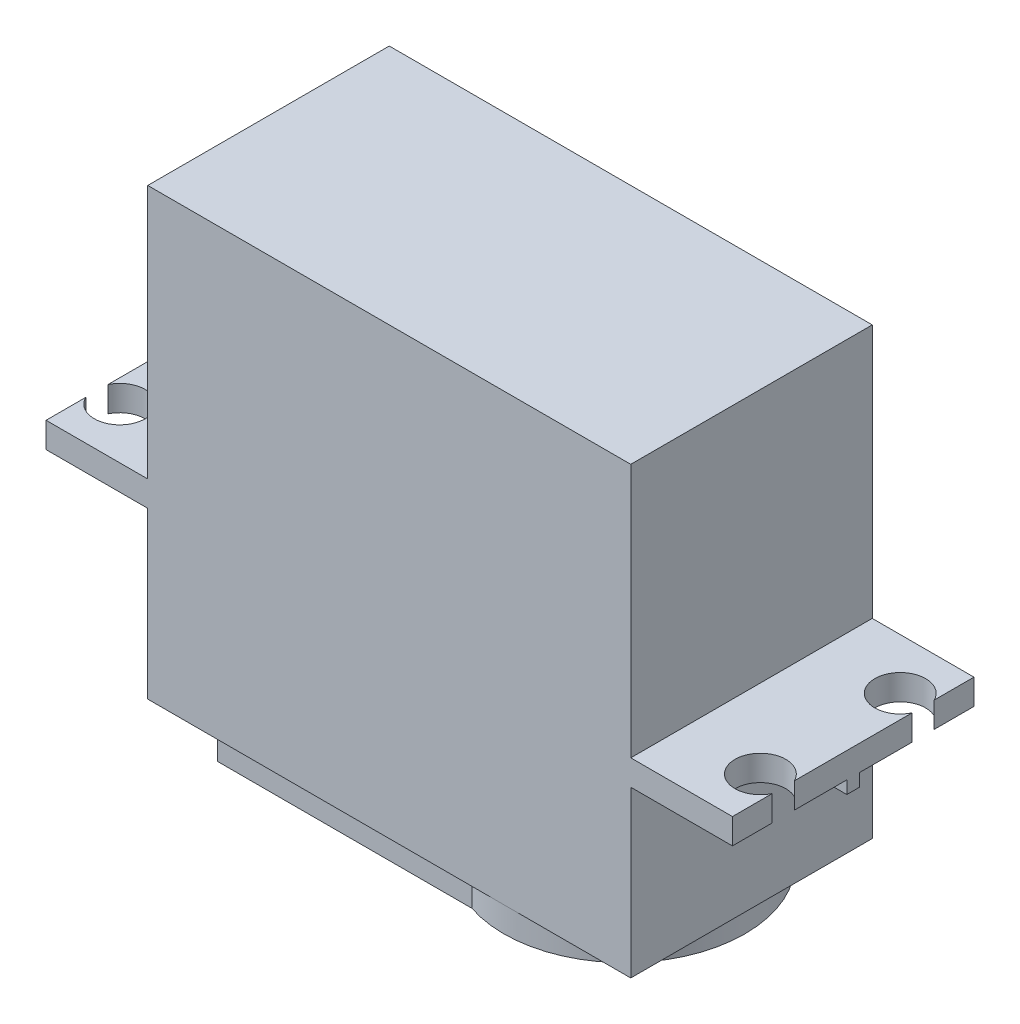
ISO-10303-21;
HEADER;
FILE_DESCRIPTION(('STEP AP214'),'2;1');
FILE_NAME('part.step','',(''),(''),'','','');
FILE_SCHEMA(('AUTOMOTIVE_DESIGN { 1 0 10303 214 1 1 1 1 }'));
ENDSEC;
DATA;
#1=APPLICATION_CONTEXT('core data for automotive mechanical design processes');
#2=APPLICATION_PROTOCOL_DEFINITION('international standard','automotive_design',2000,#1);
#3=PRODUCT_CONTEXT('',#1,'mechanical');
#4=PRODUCT('Part','Part','',(#3));
#5=PRODUCT_RELATED_PRODUCT_CATEGORY('part','',(#4));
#6=PRODUCT_DEFINITION_FORMATION('','',#4);
#7=PRODUCT_DEFINITION_CONTEXT('part definition',#1,'design');
#8=PRODUCT_DEFINITION('design','',#6,#7);
#9=PRODUCT_DEFINITION_SHAPE('','',#8);
#10=(LENGTH_UNIT() NAMED_UNIT(*) SI_UNIT(.MILLI.,.METRE.));
#11=(NAMED_UNIT(*) PLANE_ANGLE_UNIT() SI_UNIT($,.RADIAN.));
#12=(NAMED_UNIT(*) SI_UNIT($,.STERADIAN.) SOLID_ANGLE_UNIT());
#13=UNCERTAINTY_MEASURE_WITH_UNIT(LENGTH_MEASURE(1.E-05),#10,'distance_accuracy_value','');
#14=(GEOMETRIC_REPRESENTATION_CONTEXT(3) GLOBAL_UNCERTAINTY_ASSIGNED_CONTEXT((#13)) GLOBAL_UNIT_ASSIGNED_CONTEXT((#10,
#11,#12)) REPRESENTATION_CONTEXT('',''));
#15=CARTESIAN_POINT('',(0.,0.,0.));
#16=DIRECTION('',(0.,0.,1.));
#17=DIRECTION('',(1.,0.,0.));
#18=AXIS2_PLACEMENT_3D('',#15,#16,#17);
#19=CARTESIAN_POINT('',(19.,0.,19.));
#20=DIRECTION('',(0.,1.,0.));
#21=DIRECTION('',(0.,0.,1.));
#22=AXIS2_PLACEMENT_3D('',#19,#20,#21);
#23=PLANE('',#22);
#24=DIRECTION('',(1.,0.,0.));
#25=VECTOR('',#24,1.);
#26=CARTESIAN_POINT('',(19.,0.,0.));
#27=LINE('',#26,#25);
#28=CARTESIAN_POINT('',(-19.,0.,0.));
#29=VERTEX_POINT('',#28);
#30=CARTESIAN_POINT('',(19.,0.,0.));
#31=VERTEX_POINT('',#30);
#32=EDGE_CURVE('E402',#29,#31,#27,.T.);
#33=ORIENTED_EDGE('',*,*,#32,.T.);
#34=DIRECTION('',(0.,0.,-1.));
#35=VECTOR('',#34,1.);
#36=CARTESIAN_POINT('',(19.,0.,19.));
#37=LINE('',#36,#35);
#38=CARTESIAN_POINT('',(19.,0.,19.));
#39=VERTEX_POINT('',#38);
#40=EDGE_CURVE('E440',#39,#31,#37,.T.);
#41=ORIENTED_EDGE('',*,*,#40,.F.);
#42=DIRECTION('',(1.,0.,0.));
#43=VECTOR('',#42,1.);
#44=CARTESIAN_POINT('',(19.,0.,19.));
#45=LINE('',#44,#43);
#46=CARTESIAN_POINT('',(-19.,0.,19.));
#47=VERTEX_POINT('',#46);
#48=EDGE_CURVE('E374',#47,#39,#45,.T.);
#49=ORIENTED_EDGE('',*,*,#48,.F.);
#50=DIRECTION('',(0.,0.,-1.));
#51=VECTOR('',#50,1.);
#52=CARTESIAN_POINT('',(-19.,0.,19.));
#53=LINE('',#52,#51);
#54=EDGE_CURVE('E443',#47,#29,#53,.T.);
#55=ORIENTED_EDGE('',*,*,#54,.T.);
#56=EDGE_LOOP('',(#33,#41,#49,#55));
#57=FACE_BOUND('',#56,.T.);
#58=DIRECTION('',(0.,0.,-1.));
#59=VECTOR('',#58,1.);
#60=CARTESIAN_POINT('',(-14.,0.,18.5));
#61=LINE('',#60,#59);
#62=CARTESIAN_POINT('',(-14.,0.,18.5));
#63=VERTEX_POINT('',#62);
#64=CARTESIAN_POINT('',(-14.,0.,0.5));
#65=VERTEX_POINT('',#64);
#66=EDGE_CURVE('E263',#63,#65,#61,.T.);
#67=ORIENTED_EDGE('',*,*,#66,.F.);
#68=DIRECTION('',(-1.,0.,0.));
#69=VECTOR('',#68,1.);
#70=CARTESIAN_POINT('',(-14.,0.,18.5));
#71=LINE('',#70,#69);
#72=CARTESIAN_POINT('',(6.,0.,18.5));
#73=VERTEX_POINT('',#72);
#74=EDGE_CURVE('E260',#73,#63,#71,.T.);
#75=ORIENTED_EDGE('',*,*,#74,.F.);
#76=CARTESIAN_POINT('',(9.,0.,9.5));
#77=DIRECTION('',(0.,-1.,0.));
#78=DIRECTION('',(0.,0.,1.));
#79=AXIS2_PLACEMENT_3D('',#76,#77,#78);
#80=CIRCLE('',#79,9.48683298050514);
#81=CARTESIAN_POINT('',(6.,0.,0.5));
#82=VERTEX_POINT('',#81);
#83=EDGE_CURVE('E54',#82,#73,#80,.T.);
#84=ORIENTED_EDGE('',*,*,#83,.F.);
#85=DIRECTION('',(1.,0.,0.));
#86=VECTOR('',#85,1.);
#87=CARTESIAN_POINT('',(-14.,0.,0.5));
#88=LINE('',#87,#86);
#89=EDGE_CURVE('E49',#65,#82,#88,.T.);
#90=ORIENTED_EDGE('',*,*,#89,.F.);
#91=EDGE_LOOP('',(#67,#75,#84,#90));
#92=FACE_BOUND('',#91,.T.);
#93=ADVANCED_FACE('F34',(#57,#92),#23,.F.);
#94=CARTESIAN_POINT('',(19.,0.,19.));
#95=DIRECTION('',(-1.,0.,0.));
#96=DIRECTION('',(0.,0.,1.));
#97=AXIS2_PLACEMENT_3D('',#94,#95,#96);
#98=PLANE('',#97);
#99=DIRECTION('',(0.,1.,0.));
#100=VECTOR('',#99,1.);
#101=CARTESIAN_POINT('',(19.,12.,8.99999999999999));
#102=LINE('',#101,#100);
#103=CARTESIAN_POINT('',(19.,12.,8.99999999999999));
#104=VERTEX_POINT('',#103);
#105=CARTESIAN_POINT('',(19.,13.,8.99999999999999));
#106=VERTEX_POINT('',#105);
#107=EDGE_CURVE('E294',#104,#106,#102,.T.);
#108=ORIENTED_EDGE('',*,*,#107,.F.);
#109=DIRECTION('',(0.,0.,-1.));
#110=VECTOR('',#109,1.);
#111=CARTESIAN_POINT('',(19.,12.,9.99999999999999));
#112=LINE('',#111,#110);
#113=CARTESIAN_POINT('',(19.,12.,9.99999999999999));
#114=VERTEX_POINT('',#113);
#115=EDGE_CURVE('E273',#114,#104,#112,.T.);
#116=ORIENTED_EDGE('',*,*,#115,.F.);
#117=DIRECTION('',(0.,1.,0.));
#118=VECTOR('',#117,1.);
#119=CARTESIAN_POINT('',(19.,12.,9.99999999999999));
#120=LINE('',#119,#118);
#121=CARTESIAN_POINT('',(19.,13.,9.99999999999999));
#122=VERTEX_POINT('',#121);
#123=EDGE_CURVE('E282',#114,#122,#120,.T.);
#124=ORIENTED_EDGE('',*,*,#123,.T.);
#125=DIRECTION('',(0.,0.,-1.));
#126=VECTOR('',#125,1.);
#127=CARTESIAN_POINT('',(19.,13.,19.));
#128=LINE('',#127,#126);
#129=CARTESIAN_POINT('',(19.,13.,19.));
#130=VERTEX_POINT('',#129);
#131=EDGE_CURVE('E438',#130,#122,#128,.T.);
#132=ORIENTED_EDGE('',*,*,#131,.F.);
#133=DIRECTION('',(0.,1.,0.));
#134=VECTOR('',#133,1.);
#135=CARTESIAN_POINT('',(19.,0.,19.));
#136=LINE('',#135,#134);
#137=EDGE_CURVE('E376',#39,#130,#136,.T.);
#138=ORIENTED_EDGE('',*,*,#137,.F.);
#139=ORIENTED_EDGE('',*,*,#40,.T.);
#140=DIRECTION('',(0.,1.,0.));
#141=VECTOR('',#140,1.);
#142=CARTESIAN_POINT('',(19.,0.,0.));
#143=LINE('',#142,#141);
#144=CARTESIAN_POINT('',(19.,13.,0.));
#145=VERTEX_POINT('',#144);
#146=EDGE_CURVE('E404',#31,#145,#143,.T.);
#147=ORIENTED_EDGE('',*,*,#146,.T.);
#148=EDGE_CURVE('E435',#106,#145,#128,.T.);
#149=ORIENTED_EDGE('',*,*,#148,.F.);
#150=EDGE_LOOP('',(#108,#116,#124,#132,#138,#139,#147,#149));
#151=FACE_BOUND('',#150,.T.);
#152=ADVANCED_FACE('F557',(#151),#98,.F.);
#153=CARTESIAN_POINT('',(19.,13.,19.));
#154=DIRECTION('',(0.,1.,0.));
#155=DIRECTION('',(-1.,0.,0.));
#156=AXIS2_PLACEMENT_3D('',#153,#154,#155);
#157=PLANE('',#156);
#158=DIRECTION('',(1.,0.,0.));
#159=VECTOR('',#158,1.);
#160=CARTESIAN_POINT('',(19.,13.,8.99999999999999));
#161=LINE('',#160,#159);
#162=CARTESIAN_POINT('',(27.,13.,8.99999999999999));
#163=VERTEX_POINT('',#162);
#164=EDGE_CURVE('E264',#106,#163,#161,.T.);
#165=ORIENTED_EDGE('',*,*,#164,.F.);
#166=ORIENTED_EDGE('',*,*,#148,.T.);
#167=DIRECTION('',(1.,0.,0.));
#168=VECTOR('',#167,1.);
#169=CARTESIAN_POINT('',(19.,13.,0.));
#170=LINE('',#169,#168);
#171=CARTESIAN_POINT('',(27.,13.,0.));
#172=VERTEX_POINT('',#171);
#173=EDGE_CURVE('E407',#145,#172,#170,.T.);
#174=ORIENTED_EDGE('',*,*,#173,.T.);
#175=DIRECTION('',(0.,0.,-1.));
#176=VECTOR('',#175,1.);
#177=CARTESIAN_POINT('',(27.,13.,19.));
#178=LINE('',#177,#176);
#179=CARTESIAN_POINT('',(27.,13.,3.12822021129187));
#180=VERTEX_POINT('',#179);
#181=EDGE_CURVE('E430',#180,#172,#178,.T.);
#182=ORIENTED_EDGE('',*,*,#181,.F.);
#183=CARTESIAN_POINT('',(25.2,13.,4.));
#184=DIRECTION('',(0.,1.,0.));
#185=DIRECTION('',(-1.,0.,0.));
#186=AXIS2_PLACEMENT_3D('',#183,#184,#185);
#187=CIRCLE('',#186,2.);
#188=CARTESIAN_POINT('',(27.,13.,4.87177978870814));
#189=VERTEX_POINT('',#188);
#190=EDGE_CURVE('E334',#180,#189,#187,.T.);
#191=ORIENTED_EDGE('',*,*,#190,.T.);
#192=EDGE_CURVE('E437',#163,#189,#178,.T.);
#193=ORIENTED_EDGE('',*,*,#192,.F.);
#194=EDGE_LOOP('',(#165,#166,#174,#182,#191,#193));
#195=FACE_BOUND('',#194,.T.);
#196=ADVANCED_FACE('F554',(#195),#157,.F.);
#197=DIRECTION('',(-1.,0.,0.));
#198=VECTOR('',#197,1.);
#199=CARTESIAN_POINT('',(19.,13.,9.99999999999999));
#200=LINE('',#199,#198);
#201=CARTESIAN_POINT('',(27.,13.,9.99999999999999));
#202=VERTEX_POINT('',#201);
#203=EDGE_CURVE('E267',#202,#122,#200,.T.);
#204=ORIENTED_EDGE('',*,*,#203,.F.);
#205=CARTESIAN_POINT('',(27.,13.,14.1282202112919));
#206=VERTEX_POINT('',#205);
#207=EDGE_CURVE('E436',#206,#202,#178,.T.);
#208=ORIENTED_EDGE('',*,*,#207,.F.);
#209=CARTESIAN_POINT('',(25.2,13.,15.));
#210=DIRECTION('',(0.,1.,0.));
#211=DIRECTION('',(-1.,0.,0.));
#212=AXIS2_PLACEMENT_3D('',#209,#210,#211);
#213=CIRCLE('',#212,2.);
#214=CARTESIAN_POINT('',(27.,13.,15.8717797887081));
#215=VERTEX_POINT('',#214);
#216=EDGE_CURVE('E355',#206,#215,#213,.T.);
#217=ORIENTED_EDGE('',*,*,#216,.T.);
#218=CARTESIAN_POINT('',(27.,13.,19.));
#219=VERTEX_POINT('',#218);
#220=EDGE_CURVE('E432',#219,#215,#178,.T.);
#221=ORIENTED_EDGE('',*,*,#220,.F.);
#222=DIRECTION('',(1.,0.,0.));
#223=VECTOR('',#222,1.);
#224=CARTESIAN_POINT('',(19.,13.,19.));
#225=LINE('',#224,#223);
#226=EDGE_CURVE('E378',#130,#219,#225,.T.);
#227=ORIENTED_EDGE('',*,*,#226,.F.);
#228=ORIENTED_EDGE('',*,*,#131,.T.);
#229=EDGE_LOOP('',(#204,#208,#217,#221,#227,#228));
#230=FACE_BOUND('',#229,.T.);
#231=ADVANCED_FACE('F562',(#230),#157,.F.);
#232=CARTESIAN_POINT('',(-19.,13.,19.));
#233=DIRECTION('',(0.,1.,0.));
#234=DIRECTION('',(-1.,0.,0.));
#235=AXIS2_PLACEMENT_3D('',#232,#233,#234);
#236=PLANE('',#235);
#237=DIRECTION('',(-1.,0.,0.));
#238=VECTOR('',#237,1.);
#239=CARTESIAN_POINT('',(-19.,13.,10.));
#240=LINE('',#239,#238);
#241=CARTESIAN_POINT('',(-19.,13.,10.));
#242=VERTEX_POINT('',#241);
#243=CARTESIAN_POINT('',(-27.,13.,10.));
#244=VERTEX_POINT('',#243);
#245=EDGE_CURVE('E297',#242,#244,#240,.T.);
#246=ORIENTED_EDGE('',*,*,#245,.F.);
#247=DIRECTION('',(0.,0.,-1.));
#248=VECTOR('',#247,1.);
#249=CARTESIAN_POINT('',(-19.,13.,19.));
#250=LINE('',#249,#248);
#251=CARTESIAN_POINT('',(-19.,13.,19.));
#252=VERTEX_POINT('',#251);
#253=EDGE_CURVE('E447',#252,#242,#250,.T.);
#254=ORIENTED_EDGE('',*,*,#253,.F.);
#255=DIRECTION('',(1.,0.,0.));
#256=VECTOR('',#255,1.);
#257=CARTESIAN_POINT('',(-19.,13.,19.));
#258=LINE('',#257,#256);
#259=CARTESIAN_POINT('',(-27.,13.,19.));
#260=VERTEX_POINT('',#259);
#261=EDGE_CURVE('E370',#260,#252,#258,.T.);
#262=ORIENTED_EDGE('',*,*,#261,.F.);
#263=DIRECTION('',(0.,0.,-1.));
#264=VECTOR('',#263,1.);
#265=CARTESIAN_POINT('',(-27.,13.,19.));
#266=LINE('',#265,#264);
#267=CARTESIAN_POINT('',(-27.,13.,15.8717797887081));
#268=VERTEX_POINT('',#267);
#269=EDGE_CURVE('E451',#260,#268,#266,.T.);
#270=ORIENTED_EDGE('',*,*,#269,.T.);
#271=CARTESIAN_POINT('',(-25.2,13.,15.));
#272=DIRECTION('',(0.,1.,0.));
#273=DIRECTION('',(-1.,0.,0.));
#274=AXIS2_PLACEMENT_3D('',#271,#272,#273);
#275=CIRCLE('',#274,2.);
#276=CARTESIAN_POINT('',(-27.,13.,14.1282202112919));
#277=VERTEX_POINT('',#276);
#278=EDGE_CURVE('E42',#268,#277,#275,.T.);
#279=ORIENTED_EDGE('',*,*,#278,.T.);
#280=EDGE_CURVE('E455',#277,#244,#266,.T.);
#281=ORIENTED_EDGE('',*,*,#280,.T.);
#282=EDGE_LOOP('',(#246,#254,#262,#270,#279,#281));
#283=FACE_BOUND('',#282,.T.);
#284=ADVANCED_FACE('F469',(#283),#236,.F.);
#285=DIRECTION('',(1.,0.,0.));
#286=VECTOR('',#285,1.);
#287=CARTESIAN_POINT('',(-19.,13.,9.));
#288=LINE('',#287,#286);
#289=CARTESIAN_POINT('',(-27.,13.,9.));
#290=VERTEX_POINT('',#289);
#291=CARTESIAN_POINT('',(-19.,13.,9.));
#292=VERTEX_POINT('',#291);
#293=EDGE_CURVE('E302',#290,#292,#288,.T.);
#294=ORIENTED_EDGE('',*,*,#293,.F.);
#295=CARTESIAN_POINT('',(-27.,13.,4.87177978870813));
#296=VERTEX_POINT('',#295);
#297=EDGE_CURVE('E456',#290,#296,#266,.T.);
#298=ORIENTED_EDGE('',*,*,#297,.T.);
#299=CARTESIAN_POINT('',(-25.2,13.,4.));
#300=DIRECTION('',(0.,1.,0.));
#301=DIRECTION('',(-1.,0.,0.));
#302=AXIS2_PLACEMENT_3D('',#299,#300,#301);
#303=CIRCLE('',#302,2.);
#304=CARTESIAN_POINT('',(-27.,13.,3.12822021129187));
#305=VERTEX_POINT('',#304);
#306=EDGE_CURVE('E11',#296,#305,#303,.T.);
#307=ORIENTED_EDGE('',*,*,#306,.T.);
#308=CARTESIAN_POINT('',(-27.,13.,0.));
#309=VERTEX_POINT('',#308);
#310=EDGE_CURVE('E450',#305,#309,#266,.T.);
#311=ORIENTED_EDGE('',*,*,#310,.T.);
#312=DIRECTION('',(1.,0.,0.));
#313=VECTOR('',#312,1.);
#314=CARTESIAN_POINT('',(-19.,13.,0.));
#315=LINE('',#314,#313);
#316=CARTESIAN_POINT('',(-19.,13.,0.));
#317=VERTEX_POINT('',#316);
#318=EDGE_CURVE('E397',#309,#317,#315,.T.);
#319=ORIENTED_EDGE('',*,*,#318,.T.);
#320=EDGE_CURVE('E446',#292,#317,#250,.T.);
#321=ORIENTED_EDGE('',*,*,#320,.F.);
#322=EDGE_LOOP('',(#294,#298,#307,#311,#319,#321));
#323=FACE_BOUND('',#322,.T.);
#324=ADVANCED_FACE('F480',(#323),#236,.F.);
#325=CARTESIAN_POINT('',(-19.,0.,19.));
#326=DIRECTION('',(1.,0.,0.));
#327=DIRECTION('',(0.,0.,-1.));
#328=AXIS2_PLACEMENT_3D('',#325,#326,#327);
#329=PLANE('',#328);
#330=DIRECTION('',(0.,1.,0.));
#331=VECTOR('',#330,1.);
#332=CARTESIAN_POINT('',(-19.,12.,10.));
#333=LINE('',#332,#331);
#334=CARTESIAN_POINT('',(-19.,12.,10.));
#335=VERTEX_POINT('',#334);
#336=EDGE_CURVE('E310',#335,#242,#333,.T.);
#337=ORIENTED_EDGE('',*,*,#336,.F.);
#338=DIRECTION('',(0.,0.,1.));
#339=VECTOR('',#338,1.);
#340=CARTESIAN_POINT('',(-19.,12.,10.));
#341=LINE('',#340,#339);
#342=CARTESIAN_POINT('',(-19.,12.,9.));
#343=VERTEX_POINT('',#342);
#344=EDGE_CURVE('E307',#343,#335,#341,.T.);
#345=ORIENTED_EDGE('',*,*,#344,.F.);
#346=DIRECTION('',(0.,1.,0.));
#347=VECTOR('',#346,1.);
#348=CARTESIAN_POINT('',(-19.,12.,9.));
#349=LINE('',#348,#347);
#350=EDGE_CURVE('E317',#343,#292,#349,.T.);
#351=ORIENTED_EDGE('',*,*,#350,.T.);
#352=ORIENTED_EDGE('',*,*,#320,.T.);
#353=DIRECTION('',(0.,-1.,0.));
#354=VECTOR('',#353,1.);
#355=CARTESIAN_POINT('',(-19.,0.,0.));
#356=LINE('',#355,#354);
#357=EDGE_CURVE('E400',#317,#29,#356,.T.);
#358=ORIENTED_EDGE('',*,*,#357,.T.);
#359=ORIENTED_EDGE('',*,*,#54,.F.);
#360=DIRECTION('',(0.,-1.,0.));
#361=VECTOR('',#360,1.);
#362=CARTESIAN_POINT('',(-19.,0.,19.));
#363=LINE('',#362,#361);
#364=EDGE_CURVE('E372',#252,#47,#363,.T.);
#365=ORIENTED_EDGE('',*,*,#364,.F.);
#366=ORIENTED_EDGE('',*,*,#253,.T.);
#367=EDGE_LOOP('',(#337,#345,#351,#352,#358,#359,#365,#366));
#368=FACE_BOUND('',#367,.T.);
#369=ADVANCED_FACE('F496',(#368),#329,.F.);
#370=CARTESIAN_POINT('',(-27.,13.,19.));
#371=DIRECTION('',(1.,0.,0.));
#372=DIRECTION('',(0.,0.,-1.));
#373=AXIS2_PLACEMENT_3D('',#370,#371,#372);
#374=PLANE('',#373);
#375=ORIENTED_EDGE('',*,*,#310,.F.);
#376=DIRECTION('',(0.,1.,0.));
#377=VECTOR('',#376,1.);
#378=CARTESIAN_POINT('',(-27.,0.,3.12822021129187));
#379=LINE('',#378,#377);
#380=CARTESIAN_POINT('',(-27.,15.,3.12822021129187));
#381=VERTEX_POINT('',#380);
#382=EDGE_CURVE('E349',#305,#381,#379,.T.);
#383=ORIENTED_EDGE('',*,*,#382,.T.);
#384=DIRECTION('',(0.,0.,-1.));
#385=VECTOR('',#384,1.);
#386=CARTESIAN_POINT('',(-27.,15.,19.));
#387=LINE('',#386,#385);
#388=CARTESIAN_POINT('',(-27.,15.,0.));
#389=VERTEX_POINT('',#388);
#390=EDGE_CURVE('E454',#381,#389,#387,.T.);
#391=ORIENTED_EDGE('',*,*,#390,.T.);
#392=DIRECTION('',(0.,-1.,0.));
#393=VECTOR('',#392,1.);
#394=CARTESIAN_POINT('',(-27.,13.,0.));
#395=LINE('',#394,#393);
#396=EDGE_CURVE('E394',#389,#309,#395,.T.);
#397=ORIENTED_EDGE('',*,*,#396,.T.);
#398=EDGE_LOOP('',(#375,#383,#391,#397));
#399=FACE_BOUND('',#398,.T.);
#400=ADVANCED_FACE('F487',(#399),#374,.F.);
#401=CARTESIAN_POINT('',(-27.,15.,14.1282202112919));
#402=VERTEX_POINT('',#401);
#403=CARTESIAN_POINT('',(-27.,15.,4.87177978870813));
#404=VERTEX_POINT('',#403);
#405=EDGE_CURVE('E461',#402,#404,#387,.T.);
#406=ORIENTED_EDGE('',*,*,#405,.T.);
#407=DIRECTION('',(0.,1.,0.));
#408=VECTOR('',#407,1.);
#409=CARTESIAN_POINT('',(-27.,0.,4.87177978870814));
#410=LINE('',#409,#408);
#411=EDGE_CURVE('E346',#404,#296,#410,.F.);
#412=ORIENTED_EDGE('',*,*,#411,.T.);
#413=ORIENTED_EDGE('',*,*,#297,.F.);
#414=DIRECTION('',(0.,1.,0.));
#415=VECTOR('',#414,1.);
#416=CARTESIAN_POINT('',(-27.,12.,9.));
#417=LINE('',#416,#415);
#418=CARTESIAN_POINT('',(-27.,12.,9.));
#419=VERTEX_POINT('',#418);
#420=EDGE_CURVE('E319',#419,#290,#417,.T.);
#421=ORIENTED_EDGE('',*,*,#420,.F.);
#422=DIRECTION('',(0.,0.,-1.));
#423=VECTOR('',#422,1.);
#424=CARTESIAN_POINT('',(-27.,12.,9.));
#425=LINE('',#424,#423);
#426=CARTESIAN_POINT('',(-27.,12.,10.));
#427=VERTEX_POINT('',#426);
#428=EDGE_CURVE('E301',#427,#419,#425,.T.);
#429=ORIENTED_EDGE('',*,*,#428,.F.);
#430=DIRECTION('',(0.,1.,0.));
#431=VECTOR('',#430,1.);
#432=CARTESIAN_POINT('',(-27.,12.,10.));
#433=LINE('',#432,#431);
#434=EDGE_CURVE('E322',#427,#244,#433,.T.);
#435=ORIENTED_EDGE('',*,*,#434,.T.);
#436=ORIENTED_EDGE('',*,*,#280,.F.);
#437=DIRECTION('',(0.,1.,0.));
#438=VECTOR('',#437,1.);
#439=CARTESIAN_POINT('',(-27.,0.,14.1282202112919));
#440=LINE('',#439,#438);
#441=EDGE_CURVE('E343',#277,#402,#440,.T.);
#442=ORIENTED_EDGE('',*,*,#441,.T.);
#443=EDGE_LOOP('',(#406,#412,#413,#421,#429,#435,#436,#442));
#444=FACE_BOUND('',#443,.T.);
#445=ADVANCED_FACE('F475',(#444),#374,.F.);
#446=CARTESIAN_POINT('',(27.,13.,19.));
#447=DIRECTION('',(-1.,0.,0.));
#448=DIRECTION('',(0.,0.,1.));
#449=AXIS2_PLACEMENT_3D('',#446,#447,#448);
#450=PLANE('',#449);
#451=ORIENTED_EDGE('',*,*,#207,.T.);
#452=DIRECTION('',(0.,1.,0.));
#453=VECTOR('',#452,1.);
#454=CARTESIAN_POINT('',(27.,12.,9.99999999999999));
#455=LINE('',#454,#453);
#456=CARTESIAN_POINT('',(27.,12.,9.99999999999999));
#457=VERTEX_POINT('',#456);
#458=EDGE_CURVE('E288',#457,#202,#455,.T.);
#459=ORIENTED_EDGE('',*,*,#458,.F.);
#460=DIRECTION('',(0.,0.,1.));
#461=VECTOR('',#460,1.);
#462=CARTESIAN_POINT('',(27.,12.,8.99999999999999));
#463=LINE('',#462,#461);
#464=CARTESIAN_POINT('',(27.,12.,8.99999999999999));
#465=VERTEX_POINT('',#464);
#466=EDGE_CURVE('E278',#465,#457,#463,.T.);
#467=ORIENTED_EDGE('',*,*,#466,.F.);
#468=DIRECTION('',(0.,1.,0.));
#469=VECTOR('',#468,1.);
#470=CARTESIAN_POINT('',(27.,12.,8.99999999999999));
#471=LINE('',#470,#469);
#472=EDGE_CURVE('E291',#465,#163,#471,.T.);
#473=ORIENTED_EDGE('',*,*,#472,.T.);
#474=ORIENTED_EDGE('',*,*,#192,.T.);
#475=DIRECTION('',(0.,1.,0.));
#476=VECTOR('',#475,1.);
#477=CARTESIAN_POINT('',(27.,0.,4.87177978870814));
#478=LINE('',#477,#476);
#479=CARTESIAN_POINT('',(27.,15.,4.87177978870814));
#480=VERTEX_POINT('',#479);
#481=EDGE_CURVE('E337',#189,#480,#478,.T.);
#482=ORIENTED_EDGE('',*,*,#481,.T.);
#483=DIRECTION('',(0.,0.,-1.));
#484=VECTOR('',#483,1.);
#485=CARTESIAN_POINT('',(27.,15.,19.));
#486=LINE('',#485,#484);
#487=CARTESIAN_POINT('',(27.,15.,14.1282202112919));
#488=VERTEX_POINT('',#487);
#489=EDGE_CURVE('E431',#488,#480,#486,.T.);
#490=ORIENTED_EDGE('',*,*,#489,.F.);
#491=DIRECTION('',(0.,1.,0.));
#492=VECTOR('',#491,1.);
#493=CARTESIAN_POINT('',(27.,0.,14.1282202112919));
#494=LINE('',#493,#492);
#495=EDGE_CURVE('E352',#488,#206,#494,.F.);
#496=ORIENTED_EDGE('',*,*,#495,.T.);
#497=EDGE_LOOP('',(#451,#459,#467,#473,#474,#482,#490,#496));
#498=FACE_BOUND('',#497,.T.);
#499=ADVANCED_FACE('F571',(#498),#450,.F.);
#500=ORIENTED_EDGE('',*,*,#220,.T.);
#501=DIRECTION('',(0.,1.,0.));
#502=VECTOR('',#501,1.);
#503=CARTESIAN_POINT('',(27.,0.,15.8717797887081));
#504=LINE('',#503,#502);
#505=CARTESIAN_POINT('',(27.,15.,15.8717797887081));
#506=VERTEX_POINT('',#505);
#507=EDGE_CURVE('E358',#215,#506,#504,.T.);
#508=ORIENTED_EDGE('',*,*,#507,.T.);
#509=CARTESIAN_POINT('',(27.,15.,19.));
#510=VERTEX_POINT('',#509);
#511=EDGE_CURVE('E427',#510,#506,#486,.T.);
#512=ORIENTED_EDGE('',*,*,#511,.F.);
#513=DIRECTION('',(0.,1.,0.));
#514=VECTOR('',#513,1.);
#515=CARTESIAN_POINT('',(27.,13.,19.));
#516=LINE('',#515,#514);
#517=EDGE_CURVE('E380',#219,#510,#516,.T.);
#518=ORIENTED_EDGE('',*,*,#517,.F.);
#519=EDGE_LOOP('',(#500,#508,#512,#518));
#520=FACE_BOUND('',#519,.T.);
#521=ADVANCED_FACE('F566',(#520),#450,.F.);
#522=CARTESIAN_POINT('',(-19.,15.,19.));
#523=DIRECTION('',(1.,0.,0.));
#524=DIRECTION('',(0.,0.,-1.));
#525=AXIS2_PLACEMENT_3D('',#522,#523,#524);
#526=PLANE('',#525);
#527=DIRECTION('',(0.,-1.,0.));
#528=VECTOR('',#527,1.);
#529=CARTESIAN_POINT('',(-19.,15.,0.));
#530=LINE('',#529,#528);
#531=CARTESIAN_POINT('',(-19.,35.,0.));
#532=VERTEX_POINT('',#531);
#533=CARTESIAN_POINT('',(-19.,15.,0.));
#534=VERTEX_POINT('',#533);
#535=EDGE_CURVE('E361',#532,#534,#530,.T.);
#536=ORIENTED_EDGE('',*,*,#535,.T.);
#537=DIRECTION('',(0.,0.,-1.));
#538=VECTOR('',#537,1.);
#539=CARTESIAN_POINT('',(-19.,15.,19.));
#540=LINE('',#539,#538);
#541=CARTESIAN_POINT('',(-19.,15.,19.));
#542=VERTEX_POINT('',#541);
#543=EDGE_CURVE('E460',#542,#534,#540,.T.);
#544=ORIENTED_EDGE('',*,*,#543,.F.);
#545=DIRECTION('',(0.,-1.,0.));
#546=VECTOR('',#545,1.);
#547=CARTESIAN_POINT('',(-19.,15.,19.));
#548=LINE('',#547,#546);
#549=CARTESIAN_POINT('',(-19.,35.,19.));
#550=VERTEX_POINT('',#549);
#551=EDGE_CURVE('E362',#550,#542,#548,.T.);
#552=ORIENTED_EDGE('',*,*,#551,.F.);
#553=DIRECTION('',(0.,0.,-1.));
#554=VECTOR('',#553,1.);
#555=CARTESIAN_POINT('',(-19.,35.,19.));
#556=LINE('',#555,#554);
#557=EDGE_CURVE('E388',#550,#532,#556,.T.);
#558=ORIENTED_EDGE('',*,*,#557,.T.);
#559=EDGE_LOOP('',(#536,#544,#552,#558));
#560=FACE_BOUND('',#559,.T.);
#561=ADVANCED_FACE('F36',(#560),#526,.F.);
#562=CARTESIAN_POINT('',(-27.,15.,19.));
#563=DIRECTION('',(0.,-1.,0.));
#564=DIRECTION('',(1.,0.,0.));
#565=AXIS2_PLACEMENT_3D('',#562,#563,#564);
#566=PLANE('',#565);
#567=ORIENTED_EDGE('',*,*,#390,.F.);
#568=CARTESIAN_POINT('',(-25.2,15.,4.));
#569=DIRECTION('',(0.,1.,0.));
#570=DIRECTION('',(-1.,0.,0.));
#571=AXIS2_PLACEMENT_3D('',#568,#569,#570);
#572=CIRCLE('',#571,2.);
#573=EDGE_CURVE('E329',#404,#381,#572,.T.);
#574=ORIENTED_EDGE('',*,*,#573,.F.);
#575=ORIENTED_EDGE('',*,*,#405,.F.);
#576=CARTESIAN_POINT('',(-25.2,15.,15.));
#577=DIRECTION('',(0.,1.,0.));
#578=DIRECTION('',(1.,0.,0.));
#579=AXIS2_PLACEMENT_3D('',#576,#577,#578);
#580=CIRCLE('',#579,2.);
#581=CARTESIAN_POINT('',(-27.,15.,15.8717797887081));
#582=VERTEX_POINT('',#581);
#583=EDGE_CURVE('E325',#582,#402,#580,.T.);
#584=ORIENTED_EDGE('',*,*,#583,.F.);
#585=CARTESIAN_POINT('',(-27.,15.,19.));
#586=VERTEX_POINT('',#585);
#587=EDGE_CURVE('E457',#586,#582,#387,.T.);
#588=ORIENTED_EDGE('',*,*,#587,.F.);
#589=DIRECTION('',(-1.,0.,0.));
#590=VECTOR('',#589,1.);
#591=CARTESIAN_POINT('',(-27.,15.,19.));
#592=LINE('',#591,#590);
#593=EDGE_CURVE('E365',#542,#586,#592,.T.);
#594=ORIENTED_EDGE('',*,*,#593,.F.);
#595=ORIENTED_EDGE('',*,*,#543,.T.);
#596=DIRECTION('',(-1.,0.,0.));
#597=VECTOR('',#596,1.);
#598=CARTESIAN_POINT('',(-27.,15.,0.));
#599=LINE('',#598,#597);
#600=EDGE_CURVE('E391',#534,#389,#599,.T.);
#601=ORIENTED_EDGE('',*,*,#600,.T.);
#602=EDGE_LOOP('',(#567,#574,#575,#584,#588,#594,#595,#601));
#603=FACE_BOUND('',#602,.T.);
#604=ADVANCED_FACE('F521',(#603),#566,.F.);
#605=ORIENTED_EDGE('',*,*,#587,.T.);
#606=DIRECTION('',(0.,1.,0.));
#607=VECTOR('',#606,1.);
#608=CARTESIAN_POINT('',(-27.,0.,15.8717797887081));
#609=LINE('',#608,#607);
#610=EDGE_CURVE('E340',#582,#268,#609,.F.);
#611=ORIENTED_EDGE('',*,*,#610,.T.);
#612=ORIENTED_EDGE('',*,*,#269,.F.);
#613=DIRECTION('',(0.,-1.,0.));
#614=VECTOR('',#613,1.);
#615=CARTESIAN_POINT('',(-27.,13.,19.));
#616=LINE('',#615,#614);
#617=EDGE_CURVE('E368',#586,#260,#616,.T.);
#618=ORIENTED_EDGE('',*,*,#617,.F.);
#619=EDGE_LOOP('',(#605,#611,#612,#618));
#620=FACE_BOUND('',#619,.T.);
#621=ADVANCED_FACE('F526',(#620),#374,.F.);
#622=CARTESIAN_POINT('',(27.,15.,3.12822021129186));
#623=VERTEX_POINT('',#622);
#624=CARTESIAN_POINT('',(27.,15.,0.));
#625=VERTEX_POINT('',#624);
#626=EDGE_CURVE('E426',#623,#625,#486,.T.);
#627=ORIENTED_EDGE('',*,*,#626,.F.);
#628=DIRECTION('',(0.,1.,0.));
#629=VECTOR('',#628,1.);
#630=CARTESIAN_POINT('',(27.,0.,3.12822021129187));
#631=LINE('',#630,#629);
#632=EDGE_CURVE('E328',#623,#180,#631,.F.);
#633=ORIENTED_EDGE('',*,*,#632,.T.);
#634=ORIENTED_EDGE('',*,*,#181,.T.);
#635=DIRECTION('',(0.,1.,0.));
#636=VECTOR('',#635,1.);
#637=CARTESIAN_POINT('',(27.,13.,0.));
#638=LINE('',#637,#636);
#639=EDGE_CURVE('E410',#172,#625,#638,.T.);
#640=ORIENTED_EDGE('',*,*,#639,.T.);
#641=EDGE_LOOP('',(#627,#633,#634,#640));
#642=FACE_BOUND('',#641,.T.);
#643=ADVANCED_FACE('F551',(#642),#450,.F.);
#644=CARTESIAN_POINT('',(27.,15.,19.));
#645=DIRECTION('',(0.,-1.,0.));
#646=DIRECTION('',(1.,0.,0.));
#647=AXIS2_PLACEMENT_3D('',#644,#645,#646);
#648=PLANE('',#647);
#649=ORIENTED_EDGE('',*,*,#489,.T.);
#650=CARTESIAN_POINT('',(25.2,15.,4.));
#651=DIRECTION('',(0.,1.,0.));
#652=DIRECTION('',(1.,0.,0.));
#653=AXIS2_PLACEMENT_3D('',#650,#651,#652);
#654=CIRCLE('',#653,2.);
#655=EDGE_CURVE('E326',#623,#480,#654,.T.);
#656=ORIENTED_EDGE('',*,*,#655,.F.);
#657=ORIENTED_EDGE('',*,*,#626,.T.);
#658=DIRECTION('',(-1.,0.,0.));
#659=VECTOR('',#658,1.);
#660=CARTESIAN_POINT('',(27.,15.,0.));
#661=LINE('',#660,#659);
#662=CARTESIAN_POINT('',(19.,15.,0.));
#663=VERTEX_POINT('',#662);
#664=EDGE_CURVE('E413',#625,#663,#661,.T.);
#665=ORIENTED_EDGE('',*,*,#664,.T.);
#666=DIRECTION('',(0.,0.,-1.));
#667=VECTOR('',#666,1.);
#668=CARTESIAN_POINT('',(19.,15.,19.));
#669=LINE('',#668,#667);
#670=CARTESIAN_POINT('',(19.,15.,19.));
#671=VERTEX_POINT('',#670);
#672=EDGE_CURVE('E423',#671,#663,#669,.T.);
#673=ORIENTED_EDGE('',*,*,#672,.F.);
#674=DIRECTION('',(-1.,0.,0.));
#675=VECTOR('',#674,1.);
#676=CARTESIAN_POINT('',(27.,15.,19.));
#677=LINE('',#676,#675);
#678=EDGE_CURVE('E382',#510,#671,#677,.T.);
#679=ORIENTED_EDGE('',*,*,#678,.F.);
#680=ORIENTED_EDGE('',*,*,#511,.T.);
#681=CARTESIAN_POINT('',(25.2,15.,15.));
#682=DIRECTION('',(0.,-1.,0.));
#683=DIRECTION('',(1.,0.,0.));
#684=AXIS2_PLACEMENT_3D('',#681,#682,#683);
#685=CIRCLE('',#684,2.);
#686=EDGE_CURVE('E464',#506,#488,#685,.T.);
#687=ORIENTED_EDGE('',*,*,#686,.T.);
#688=EDGE_LOOP('',(#649,#656,#657,#665,#673,#679,#680,#687));
#689=FACE_BOUND('',#688,.T.);
#690=ADVANCED_FACE('F545',(#689),#648,.F.);
#691=CARTESIAN_POINT('',(19.,15.,19.));
#692=DIRECTION('',(-1.,0.,0.));
#693=DIRECTION('',(0.,0.,1.));
#694=AXIS2_PLACEMENT_3D('',#691,#692,#693);
#695=PLANE('',#694);
#696=DIRECTION('',(0.,1.,0.));
#697=VECTOR('',#696,1.);
#698=CARTESIAN_POINT('',(19.,15.,0.));
#699=LINE('',#698,#697);
#700=CARTESIAN_POINT('',(19.,35.,0.));
#701=VERTEX_POINT('',#700);
#702=EDGE_CURVE('E415',#663,#701,#699,.T.);
#703=ORIENTED_EDGE('',*,*,#702,.T.);
#704=DIRECTION('',(0.,0.,-1.));
#705=VECTOR('',#704,1.);
#706=CARTESIAN_POINT('',(19.,35.,19.));
#707=LINE('',#706,#705);
#708=CARTESIAN_POINT('',(19.,35.,19.));
#709=VERTEX_POINT('',#708);
#710=EDGE_CURVE('E420',#709,#701,#707,.T.);
#711=ORIENTED_EDGE('',*,*,#710,.F.);
#712=DIRECTION('',(0.,1.,0.));
#713=VECTOR('',#712,1.);
#714=CARTESIAN_POINT('',(19.,15.,19.));
#715=LINE('',#714,#713);
#716=EDGE_CURVE('E384',#671,#709,#715,.T.);
#717=ORIENTED_EDGE('',*,*,#716,.F.);
#718=ORIENTED_EDGE('',*,*,#672,.T.);
#719=EDGE_LOOP('',(#703,#711,#717,#718));
#720=FACE_BOUND('',#719,.T.);
#721=ADVANCED_FACE('F540',(#720),#695,.F.);
#722=CARTESIAN_POINT('',(-19.,35.,19.));
#723=DIRECTION('',(0.,-1.,0.));
#724=DIRECTION('',(0.,0.,-1.));
#725=AXIS2_PLACEMENT_3D('',#722,#723,#724);
#726=PLANE('',#725);
#727=DIRECTION('',(-1.,0.,0.));
#728=VECTOR('',#727,1.);
#729=CARTESIAN_POINT('',(-19.,35.,0.));
#730=LINE('',#729,#728);
#731=EDGE_CURVE('E366',#701,#532,#730,.T.);
#732=ORIENTED_EDGE('',*,*,#731,.T.);
#733=ORIENTED_EDGE('',*,*,#557,.F.);
#734=DIRECTION('',(-1.,0.,0.));
#735=VECTOR('',#734,1.);
#736=CARTESIAN_POINT('',(-19.,35.,19.));
#737=LINE('',#736,#735);
#738=EDGE_CURVE('E386',#709,#550,#737,.T.);
#739=ORIENTED_EDGE('',*,*,#738,.F.);
#740=ORIENTED_EDGE('',*,*,#710,.T.);
#741=EDGE_LOOP('',(#732,#733,#739,#740));
#742=FACE_BOUND('',#741,.T.);
#743=ADVANCED_FACE('F535',(#742),#726,.F.);
#744=CARTESIAN_POINT('',(0.,0.,19.));
#745=DIRECTION('',(0.,0.,-1.));
#746=DIRECTION('',(-1.,0.,0.));
#747=AXIS2_PLACEMENT_3D('',#744,#745,#746);
#748=PLANE('',#747);
#749=ORIENTED_EDGE('',*,*,#551,.T.);
#750=ORIENTED_EDGE('',*,*,#593,.T.);
#751=ORIENTED_EDGE('',*,*,#617,.T.);
#752=ORIENTED_EDGE('',*,*,#261,.T.);
#753=ORIENTED_EDGE('',*,*,#364,.T.);
#754=ORIENTED_EDGE('',*,*,#48,.T.);
#755=ORIENTED_EDGE('',*,*,#137,.T.);
#756=ORIENTED_EDGE('',*,*,#226,.T.);
#757=ORIENTED_EDGE('',*,*,#517,.T.);
#758=ORIENTED_EDGE('',*,*,#678,.T.);
#759=ORIENTED_EDGE('',*,*,#716,.T.);
#760=ORIENTED_EDGE('',*,*,#738,.T.);
#761=EDGE_LOOP('',(#749,#750,#751,#752,#753,#754,#755,#756,#757,#758,#759,#760));
#762=FACE_BOUND('',#761,.T.);
#763=ADVANCED_FACE('F503',(#762),#748,.F.);
#764=CARTESIAN_POINT('',(0.,0.,0.));
#765=DIRECTION('',(0.,0.,-1.));
#766=DIRECTION('',(-1.,0.,0.));
#767=AXIS2_PLACEMENT_3D('',#764,#765,#766);
#768=PLANE('',#767);
#769=ORIENTED_EDGE('',*,*,#535,.F.);
#770=ORIENTED_EDGE('',*,*,#731,.F.);
#771=ORIENTED_EDGE('',*,*,#702,.F.);
#772=ORIENTED_EDGE('',*,*,#664,.F.);
#773=ORIENTED_EDGE('',*,*,#639,.F.);
#774=ORIENTED_EDGE('',*,*,#173,.F.);
#775=ORIENTED_EDGE('',*,*,#146,.F.);
#776=ORIENTED_EDGE('',*,*,#32,.F.);
#777=ORIENTED_EDGE('',*,*,#357,.F.);
#778=ORIENTED_EDGE('',*,*,#318,.F.);
#779=ORIENTED_EDGE('',*,*,#396,.F.);
#780=ORIENTED_EDGE('',*,*,#600,.F.);
#781=EDGE_LOOP('',(#769,#770,#771,#772,#773,#774,#775,#776,#777,#778,#779,#780));
#782=FACE_BOUND('',#781,.T.);
#783=ADVANCED_FACE('F491',(#782),#768,.T.);
#784=CARTESIAN_POINT('',(25.2,0.,15.));
#785=DIRECTION('',(0.,1.,0.));
#786=DIRECTION('',(-1.,0.,0.));
#787=AXIS2_PLACEMENT_3D('',#784,#785,#786);
#788=CYLINDRICAL_SURFACE('',#787,2.);
#789=ORIENTED_EDGE('',*,*,#216,.F.);
#790=ORIENTED_EDGE('',*,*,#495,.F.);
#791=ORIENTED_EDGE('',*,*,#686,.F.);
#792=ORIENTED_EDGE('',*,*,#507,.F.);
#793=EDGE_LOOP('',(#789,#790,#791,#792));
#794=FACE_BOUND('',#793,.T.);
#795=ADVANCED_FACE('F587',(#794),#788,.F.);
#796=CARTESIAN_POINT('',(25.2,0.,4.));
#797=DIRECTION('',(0.,1.,0.));
#798=DIRECTION('',(-1.,0.,0.));
#799=AXIS2_PLACEMENT_3D('',#796,#797,#798);
#800=CYLINDRICAL_SURFACE('',#799,2.);
#801=ORIENTED_EDGE('',*,*,#190,.F.);
#802=ORIENTED_EDGE('',*,*,#632,.F.);
#803=ORIENTED_EDGE('',*,*,#655,.T.);
#804=ORIENTED_EDGE('',*,*,#481,.F.);
#805=EDGE_LOOP('',(#801,#802,#803,#804));
#806=FACE_BOUND('',#805,.T.);
#807=ADVANCED_FACE('F575',(#806),#800,.F.);
#808=CARTESIAN_POINT('',(-25.2,0.,15.));
#809=DIRECTION('',(0.,1.,0.));
#810=DIRECTION('',(-1.,0.,0.));
#811=AXIS2_PLACEMENT_3D('',#808,#809,#810);
#812=CYLINDRICAL_SURFACE('',#811,2.);
#813=ORIENTED_EDGE('',*,*,#278,.F.);
#814=ORIENTED_EDGE('',*,*,#610,.F.);
#815=ORIENTED_EDGE('',*,*,#583,.T.);
#816=ORIENTED_EDGE('',*,*,#441,.F.);
#817=EDGE_LOOP('',(#813,#814,#815,#816));
#818=FACE_BOUND('',#817,.T.);
#819=ADVANCED_FACE('F594',(#818),#812,.F.);
#820=CARTESIAN_POINT('',(-25.2,0.,4.));
#821=DIRECTION('',(0.,1.,0.));
#822=DIRECTION('',(-1.,0.,0.));
#823=AXIS2_PLACEMENT_3D('',#820,#821,#822);
#824=CYLINDRICAL_SURFACE('',#823,2.);
#825=ORIENTED_EDGE('',*,*,#306,.F.);
#826=ORIENTED_EDGE('',*,*,#411,.F.);
#827=ORIENTED_EDGE('',*,*,#573,.T.);
#828=ORIENTED_EDGE('',*,*,#382,.F.);
#829=EDGE_LOOP('',(#825,#826,#827,#828));
#830=FACE_BOUND('',#829,.T.);
#831=ADVANCED_FACE('F518',(#830),#824,.F.);
#832=CARTESIAN_POINT('',(-19.,12.,10.));
#833=DIRECTION('',(0.,0.,-1.));
#834=DIRECTION('',(-1.,0.,0.));
#835=AXIS2_PLACEMENT_3D('',#832,#833,#834);
#836=PLANE('',#835);
#837=ORIENTED_EDGE('',*,*,#245,.T.);
#838=ORIENTED_EDGE('',*,*,#434,.F.);
#839=DIRECTION('',(-1.,0.,0.));
#840=VECTOR('',#839,1.);
#841=CARTESIAN_POINT('',(-19.,12.,10.));
#842=LINE('',#841,#840);
#843=EDGE_CURVE('E298',#335,#427,#842,.T.);
#844=ORIENTED_EDGE('',*,*,#843,.F.);
#845=ORIENTED_EDGE('',*,*,#336,.T.);
#846=EDGE_LOOP('',(#837,#838,#844,#845));
#847=FACE_BOUND('',#846,.T.);
#848=ADVANCED_FACE('F508',(#847),#836,.F.);
#849=CARTESIAN_POINT('',(-19.,12.,9.));
#850=DIRECTION('',(0.,0.,1.));
#851=DIRECTION('',(1.,0.,0.));
#852=AXIS2_PLACEMENT_3D('',#849,#850,#851);
#853=PLANE('',#852);
#854=ORIENTED_EDGE('',*,*,#293,.T.);
#855=ORIENTED_EDGE('',*,*,#350,.F.);
#856=DIRECTION('',(1.,0.,0.));
#857=VECTOR('',#856,1.);
#858=CARTESIAN_POINT('',(-19.,12.,9.));
#859=LINE('',#858,#857);
#860=EDGE_CURVE('E304',#419,#343,#859,.T.);
#861=ORIENTED_EDGE('',*,*,#860,.F.);
#862=ORIENTED_EDGE('',*,*,#420,.T.);
#863=EDGE_LOOP('',(#854,#855,#861,#862));
#864=FACE_BOUND('',#863,.T.);
#865=ADVANCED_FACE('F516',(#864),#853,.F.);
#866=CARTESIAN_POINT('',(0.,12.,0.));
#867=DIRECTION('',(0.,1.,0.));
#868=DIRECTION('',(-1.,0.,0.));
#869=AXIS2_PLACEMENT_3D('',#866,#867,#868);
#870=PLANE('',#869);
#871=ORIENTED_EDGE('',*,*,#843,.T.);
#872=ORIENTED_EDGE('',*,*,#428,.T.);
#873=ORIENTED_EDGE('',*,*,#860,.T.);
#874=ORIENTED_EDGE('',*,*,#344,.T.);
#875=EDGE_LOOP('',(#871,#872,#873,#874));
#876=FACE_BOUND('',#875,.T.);
#877=ADVANCED_FACE('F510',(#876),#870,.F.);
#878=CARTESIAN_POINT('',(19.,12.,8.99999999999999));
#879=DIRECTION('',(0.,0.,1.));
#880=DIRECTION('',(1.,0.,0.));
#881=AXIS2_PLACEMENT_3D('',#878,#879,#880);
#882=PLANE('',#881);
#883=ORIENTED_EDGE('',*,*,#164,.T.);
#884=ORIENTED_EDGE('',*,*,#472,.F.);
#885=DIRECTION('',(1.,0.,0.));
#886=VECTOR('',#885,1.);
#887=CARTESIAN_POINT('',(19.,12.,8.99999999999999));
#888=LINE('',#887,#886);
#889=EDGE_CURVE('E276',#104,#465,#888,.T.);
#890=ORIENTED_EDGE('',*,*,#889,.F.);
#891=ORIENTED_EDGE('',*,*,#107,.T.);
#892=EDGE_LOOP('',(#883,#884,#890,#891));
#893=FACE_BOUND('',#892,.T.);
#894=ADVANCED_FACE('F578',(#893),#882,.F.);
#895=CARTESIAN_POINT('',(19.,12.,9.99999999999999));
#896=DIRECTION('',(0.,0.,-1.));
#897=DIRECTION('',(-1.,0.,0.));
#898=AXIS2_PLACEMENT_3D('',#895,#896,#897);
#899=PLANE('',#898);
#900=ORIENTED_EDGE('',*,*,#203,.T.);
#901=ORIENTED_EDGE('',*,*,#123,.F.);
#902=DIRECTION('',(-1.,0.,0.));
#903=VECTOR('',#902,1.);
#904=CARTESIAN_POINT('',(19.,12.,9.99999999999999));
#905=LINE('',#904,#903);
#906=EDGE_CURVE('E280',#457,#114,#905,.T.);
#907=ORIENTED_EDGE('',*,*,#906,.F.);
#908=ORIENTED_EDGE('',*,*,#458,.T.);
#909=EDGE_LOOP('',(#900,#901,#907,#908));
#910=FACE_BOUND('',#909,.T.);
#911=ADVANCED_FACE('F586',(#910),#899,.F.);
#912=CARTESIAN_POINT('',(0.,12.,0.));
#913=DIRECTION('',(0.,-1.,0.));
#914=DIRECTION('',(1.,0.,0.));
#915=AXIS2_PLACEMENT_3D('',#912,#913,#914);
#916=PLANE('',#915);
#917=ORIENTED_EDGE('',*,*,#115,.T.);
#918=ORIENTED_EDGE('',*,*,#889,.T.);
#919=ORIENTED_EDGE('',*,*,#466,.T.);
#920=ORIENTED_EDGE('',*,*,#906,.T.);
#921=EDGE_LOOP('',(#917,#918,#919,#920));
#922=FACE_BOUND('',#921,.T.);
#923=ADVANCED_FACE('F584',(#922),#916,.T.);
#924=CARTESIAN_POINT('',(-14.,-2.,18.5));
#925=DIRECTION('',(1.,0.,0.));
#926=DIRECTION('',(0.,0.,-1.));
#927=AXIS2_PLACEMENT_3D('',#924,#925,#926);
#928=PLANE('',#927);
#929=ORIENTED_EDGE('',*,*,#66,.T.);
#930=DIRECTION('',(0.,1.,0.));
#931=VECTOR('',#930,1.);
#932=CARTESIAN_POINT('',(-14.,-2.,0.5));
#933=LINE('',#932,#931);
#934=CARTESIAN_POINT('',(-14.,-2.,0.5));
#935=VERTEX_POINT('',#934);
#936=EDGE_CURVE('E244',#935,#65,#933,.T.);
#937=ORIENTED_EDGE('',*,*,#936,.F.);
#938=DIRECTION('',(0.,0.,-1.));
#939=VECTOR('',#938,1.);
#940=CARTESIAN_POINT('',(-14.,-2.,18.5));
#941=LINE('',#940,#939);
#942=CARTESIAN_POINT('',(-14.,-2.,18.5));
#943=VERTEX_POINT('',#942);
#944=EDGE_CURVE('E251',#943,#935,#941,.T.);
#945=ORIENTED_EDGE('',*,*,#944,.F.);
#946=DIRECTION('',(0.,1.,0.));
#947=VECTOR('',#946,1.);
#948=CARTESIAN_POINT('',(-14.,-2.,18.5));
#949=LINE('',#948,#947);
#950=EDGE_CURVE('E885',#943,#63,#949,.T.);
#951=ORIENTED_EDGE('',*,*,#950,.T.);
#952=EDGE_LOOP('',(#929,#937,#945,#951));
#953=FACE_BOUND('',#952,.T.);
#954=ADVANCED_FACE('F262',(#953),#928,.F.);
#955=CARTESIAN_POINT('',(-14.,-2.,0.5));
#956=DIRECTION('',(0.,0.,1.));
#957=DIRECTION('',(1.,0.,0.));
#958=AXIS2_PLACEMENT_3D('',#955,#956,#957);
#959=PLANE('',#958);
#960=ORIENTED_EDGE('',*,*,#89,.T.);
#961=DIRECTION('',(0.,1.,0.));
#962=VECTOR('',#961,1.);
#963=CARTESIAN_POINT('',(6.,-2.,0.5));
#964=LINE('',#963,#962);
#965=CARTESIAN_POINT('',(6.,-2.,0.5));
#966=VERTEX_POINT('',#965);
#967=EDGE_CURVE('E247',#966,#82,#964,.T.);
#968=ORIENTED_EDGE('',*,*,#967,.F.);
#969=DIRECTION('',(1.,0.,0.));
#970=VECTOR('',#969,1.);
#971=CARTESIAN_POINT('',(-14.,-2.,0.5));
#972=LINE('',#971,#970);
#973=EDGE_CURVE('E240',#935,#966,#972,.T.);
#974=ORIENTED_EDGE('',*,*,#973,.F.);
#975=ORIENTED_EDGE('',*,*,#936,.T.);
#976=EDGE_LOOP('',(#960,#968,#974,#975));
#977=FACE_BOUND('',#976,.T.);
#978=ADVANCED_FACE('F242',(#977),#959,.F.);
#979=CARTESIAN_POINT('',(9.,-2.,9.5));
#980=DIRECTION('',(0.,1.,0.));
#981=DIRECTION('',(0.,0.,1.));
#982=AXIS2_PLACEMENT_3D('',#979,#980,#981);
#983=CYLINDRICAL_SURFACE('',#982,9.48683298050514);
#984=ORIENTED_EDGE('',*,*,#83,.T.);
#985=DIRECTION('',(0.,1.,0.));
#986=VECTOR('',#985,1.);
#987=CARTESIAN_POINT('',(6.,-2.,18.5));
#988=LINE('',#987,#986);
#989=CARTESIAN_POINT('',(6.,-2.,18.5));
#990=VERTEX_POINT('',#989);
#991=EDGE_CURVE('E269',#990,#73,#988,.T.);
#992=ORIENTED_EDGE('',*,*,#991,.F.);
#993=CARTESIAN_POINT('',(9.,-2.,9.5));
#994=DIRECTION('',(0.,-1.,0.));
#995=DIRECTION('',(0.,0.,1.));
#996=AXIS2_PLACEMENT_3D('',#993,#994,#995);
#997=CIRCLE('',#996,9.48683298050514);
#998=EDGE_CURVE('E250',#966,#990,#997,.T.);
#999=ORIENTED_EDGE('',*,*,#998,.F.);
#1000=ORIENTED_EDGE('',*,*,#967,.T.);
#1001=EDGE_LOOP('',(#984,#992,#999,#1000));
#1002=FACE_BOUND('',#1001,.T.);
#1003=ADVANCED_FACE('F823',(#1002),#983,.T.);
#1004=CARTESIAN_POINT('',(-14.,-2.,18.5));
#1005=DIRECTION('',(0.,0.,-1.));
#1006=DIRECTION('',(-1.,0.,0.));
#1007=AXIS2_PLACEMENT_3D('',#1004,#1005,#1006);
#1008=PLANE('',#1007);
#1009=ORIENTED_EDGE('',*,*,#74,.T.);
#1010=ORIENTED_EDGE('',*,*,#950,.F.);
#1011=DIRECTION('',(-1.,0.,0.));
#1012=VECTOR('',#1011,1.);
#1013=CARTESIAN_POINT('',(-14.,-2.,18.5));
#1014=LINE('',#1013,#1012);
#1015=EDGE_CURVE('E256',#990,#943,#1014,.T.);
#1016=ORIENTED_EDGE('',*,*,#1015,.F.);
#1017=ORIENTED_EDGE('',*,*,#991,.T.);
#1018=EDGE_LOOP('',(#1009,#1010,#1016,#1017));
#1019=FACE_BOUND('',#1018,.T.);
#1020=ADVANCED_FACE('F832',(#1019),#1008,.F.);
#1021=CARTESIAN_POINT('',(9.,-2.,9.5));
#1022=DIRECTION('',(0.,1.,0.));
#1023=DIRECTION('',(0.,0.,1.));
#1024=AXIS2_PLACEMENT_3D('',#1021,#1022,#1023);
#1025=PLANE('',#1024);
#1026=CARTESIAN_POINT('',(9.,-2.,9.5));
#1027=DIRECTION('',(0.,-1.,0.));
#1028=DIRECTION('',(0.,0.,-1.));
#1029=AXIS2_PLACEMENT_3D('',#1026,#1027,#1028);
#1030=CIRCLE('',#1029,3.);
#1031=CARTESIAN_POINT('',(9.,-2.,6.5));
#1032=VERTEX_POINT('',#1031);
#1033=EDGE_CURVE('E878',#1032,#1032,#1030,.T.);
#1034=ORIENTED_EDGE('',*,*,#1033,.F.);
#1035=EDGE_LOOP('',(#1034));
#1036=FACE_BOUND('',#1035,.T.);
#1037=ORIENTED_EDGE('',*,*,#944,.T.);
#1038=ORIENTED_EDGE('',*,*,#973,.T.);
#1039=ORIENTED_EDGE('',*,*,#998,.T.);
#1040=ORIENTED_EDGE('',*,*,#1015,.T.);
#1041=EDGE_LOOP('',(#1037,#1038,#1039,#1040));
#1042=FACE_BOUND('',#1041,.T.);
#1043=ADVANCED_FACE('F254',(#1036,#1042),#1025,.F.);
#1044=CARTESIAN_POINT('',(9.,3.,9.5));
#1045=DIRECTION('',(0.,-1.,0.));
#1046=DIRECTION('',(0.,0.,-1.));
#1047=AXIS2_PLACEMENT_3D('',#1044,#1045,#1046);
#1048=CYLINDRICAL_SURFACE('',#1047,3.);
#1049=CARTESIAN_POINT('',(9.,3.,9.5));
#1050=DIRECTION('',(0.,-1.,0.));
#1051=DIRECTION('',(0.,0.,-1.));
#1052=AXIS2_PLACEMENT_3D('',#1049,#1050,#1051);
#1053=CIRCLE('',#1052,3.);
#1054=CARTESIAN_POINT('',(9.,3.,6.5));
#1055=VERTEX_POINT('',#1054);
#1056=EDGE_CURVE('E877',#1055,#1055,#1053,.T.);
#1057=ORIENTED_EDGE('',*,*,#1056,.F.);
#1058=EDGE_LOOP('',(#1057));
#1059=FACE_BOUND('',#1058,.T.);
#1060=ORIENTED_EDGE('',*,*,#1033,.T.);
#1061=EDGE_LOOP('',(#1060));
#1062=FACE_BOUND('',#1061,.T.);
#1063=ADVANCED_FACE('F851',(#1059,#1062),#1048,.F.);
#1064=CARTESIAN_POINT('',(9.,3.,9.5));
#1065=DIRECTION('',(0.,-1.,0.));
#1066=DIRECTION('',(0.,0.,-1.));
#1067=AXIS2_PLACEMENT_3D('',#1064,#1065,#1066);
#1068=PLANE('',#1067);
#1069=ORIENTED_EDGE('',*,*,#1056,.T.);
#1070=EDGE_LOOP('',(#1069));
#1071=FACE_BOUND('',#1070,.T.);
#1072=ADVANCED_FACE('F861',(#1071),#1068,.T.);
#1073=CLOSED_SHELL('',(#93,#152,#196,#231,#284,#324,#369,#400,#445,#499,#521,#561,#604,#621,
#643,#690,#721,#743,#763,#783,#795,#807,#819,#831,#848,#865,#877,#894,#911,#923,#954,#978,#1003,
#1020,#1043,#1063,#1072));
#1074=MANIFOLD_SOLID_BREP('B2',#1073);
#1075=ADVANCED_BREP_SHAPE_REPRESENTATION('',(#18,#1074),#14);
#1076=SHAPE_DEFINITION_REPRESENTATION(#9,#1075);
ENDSEC;
END-ISO-10303-21;
